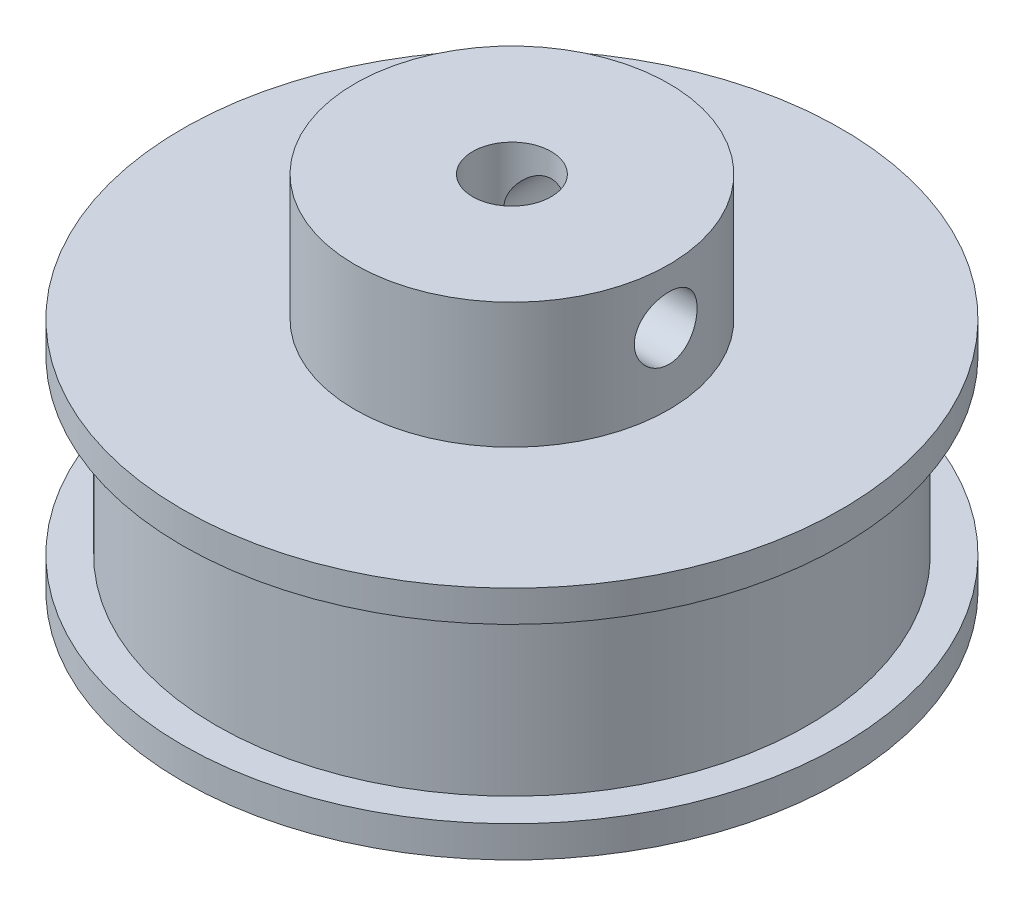
ISO-10303-21;
HEADER;
FILE_DESCRIPTION(('STEP AP214'),'2;1');
FILE_NAME('part.step','',(''),(''),'','','');
FILE_SCHEMA(('AUTOMOTIVE_DESIGN { 1 0 10303 214 1 1 1 1 }'));
ENDSEC;
DATA;
#1=APPLICATION_CONTEXT('core data for automotive mechanical design processes');
#2=APPLICATION_PROTOCOL_DEFINITION('international standard','automotive_design',2000,#1);
#3=PRODUCT_CONTEXT('',#1,'mechanical');
#4=PRODUCT('Part','Part','',(#3));
#5=PRODUCT_RELATED_PRODUCT_CATEGORY('part','',(#4));
#6=PRODUCT_DEFINITION_FORMATION('','',#4);
#7=PRODUCT_DEFINITION_CONTEXT('part definition',#1,'design');
#8=PRODUCT_DEFINITION('design','',#6,#7);
#9=PRODUCT_DEFINITION_SHAPE('','',#8);
#10=(LENGTH_UNIT() NAMED_UNIT(*) SI_UNIT(.MILLI.,.METRE.));
#11=(NAMED_UNIT(*) PLANE_ANGLE_UNIT() SI_UNIT($,.RADIAN.));
#12=(NAMED_UNIT(*) SI_UNIT($,.STERADIAN.) SOLID_ANGLE_UNIT());
#13=UNCERTAINTY_MEASURE_WITH_UNIT(LENGTH_MEASURE(1.E-05),#10,'distance_accuracy_value','');
#14=(GEOMETRIC_REPRESENTATION_CONTEXT(3) GLOBAL_UNCERTAINTY_ASSIGNED_CONTEXT((#13)) GLOBAL_UNIT_ASSIGNED_CONTEXT((#10,
#11,#12)) REPRESENTATION_CONTEXT('',''));
#15=CARTESIAN_POINT('',(0.,0.,0.));
#16=DIRECTION('',(0.,0.,1.));
#17=DIRECTION('',(1.,0.,0.));
#18=AXIS2_PLACEMENT_3D('',#15,#16,#17);
#19=CARTESIAN_POINT('',(0.,2.,0.));
#20=DIRECTION('',(0.,-1.,0.));
#21=DIRECTION('',(0.,0.,-1.));
#22=AXIS2_PLACEMENT_3D('',#19,#20,#21);
#23=CYLINDRICAL_SURFACE('',#22,21.);
#24=CARTESIAN_POINT('',(0.,2.,0.));
#25=DIRECTION('',(0.,1.,0.));
#26=DIRECTION('',(0.,0.,1.));
#27=AXIS2_PLACEMENT_3D('',#24,#25,#26);
#28=CIRCLE('',#27,21.);
#29=CARTESIAN_POINT('',(0.,2.,21.));
#30=VERTEX_POINT('',#29);
#31=EDGE_CURVE('E135',#30,#30,#28,.T.);
#32=ORIENTED_EDGE('',*,*,#31,.F.);
#33=EDGE_LOOP('',(#32));
#34=FACE_BOUND('',#33,.T.);
#35=CARTESIAN_POINT('',(0.,0.,0.));
#36=DIRECTION('',(0.,1.,0.));
#37=DIRECTION('',(0.,0.,1.));
#38=AXIS2_PLACEMENT_3D('',#35,#36,#37);
#39=CIRCLE('',#38,21.);
#40=CARTESIAN_POINT('',(0.,0.,21.));
#41=VERTEX_POINT('',#40);
#42=EDGE_CURVE('E76',#41,#41,#39,.T.);
#43=ORIENTED_EDGE('',*,*,#42,.T.);
#44=EDGE_LOOP('',(#43));
#45=FACE_BOUND('',#44,.T.);
#46=ADVANCED_FACE('F37',(#34,#45),#23,.T.);
#47=CARTESIAN_POINT('',(0.,2.,0.));
#48=DIRECTION('',(0.,1.,0.));
#49=DIRECTION('',(0.,0.,1.));
#50=AXIS2_PLACEMENT_3D('',#47,#48,#49);
#51=PLANE('',#50);
#52=CARTESIAN_POINT('',(0.,2.,0.));
#53=DIRECTION('',(0.,1.,0.));
#54=DIRECTION('',(0.,0.,1.));
#55=AXIS2_PLACEMENT_3D('',#52,#53,#54);
#56=CIRCLE('',#55,18.85);
#57=CARTESIAN_POINT('',(0.,2.,18.85));
#58=VERTEX_POINT('',#57);
#59=EDGE_CURVE('E139',#58,#58,#56,.T.);
#60=ORIENTED_EDGE('',*,*,#59,.F.);
#61=EDGE_LOOP('',(#60));
#62=FACE_BOUND('',#61,.T.);
#63=ORIENTED_EDGE('',*,*,#31,.T.);
#64=EDGE_LOOP('',(#63));
#65=FACE_BOUND('',#64,.T.);
#66=ADVANCED_FACE('F119',(#62,#65),#51,.T.);
#67=CARTESIAN_POINT('',(0.,0.,0.));
#68=DIRECTION('',(0.,1.,0.));
#69=DIRECTION('',(0.,0.,1.));
#70=AXIS2_PLACEMENT_3D('',#67,#68,#69);
#71=PLANE('',#70);
#72=CARTESIAN_POINT('',(0.,0.,0.));
#73=DIRECTION('',(0.,1.,0.));
#74=DIRECTION('',(0.,0.,1.));
#75=AXIS2_PLACEMENT_3D('',#72,#73,#74);
#76=CIRCLE('',#75,2.5);
#77=CARTESIAN_POINT('',(0.,0.,2.5));
#78=VERTEX_POINT('',#77);
#79=EDGE_CURVE('E93',#78,#78,#76,.T.);
#80=ORIENTED_EDGE('',*,*,#79,.T.);
#81=EDGE_LOOP('',(#80));
#82=FACE_BOUND('',#81,.T.);
#83=ORIENTED_EDGE('',*,*,#42,.F.);
#84=EDGE_LOOP('',(#83));
#85=FACE_BOUND('',#84,.T.);
#86=ADVANCED_FACE('F117',(#82,#85),#71,.F.);
#87=CARTESIAN_POINT('',(0.,13.,0.));
#88=DIRECTION('',(0.,-1.,0.));
#89=DIRECTION('',(0.,0.,-1.));
#90=AXIS2_PLACEMENT_3D('',#87,#88,#89);
#91=CYLINDRICAL_SURFACE('',#90,18.85);
#92=CARTESIAN_POINT('',(0.,13.,0.));
#93=DIRECTION('',(0.,1.,0.));
#94=DIRECTION('',(0.,0.,1.));
#95=AXIS2_PLACEMENT_3D('',#92,#93,#94);
#96=CIRCLE('',#95,18.85);
#97=CARTESIAN_POINT('',(0.,13.,18.85));
#98=VERTEX_POINT('',#97);
#99=EDGE_CURVE('E138',#98,#98,#96,.T.);
#100=ORIENTED_EDGE('',*,*,#99,.F.);
#101=EDGE_LOOP('',(#100));
#102=FACE_BOUND('',#101,.T.);
#103=ORIENTED_EDGE('',*,*,#59,.T.);
#104=EDGE_LOOP('',(#103));
#105=FACE_BOUND('',#104,.T.);
#106=ADVANCED_FACE('F113',(#102,#105),#91,.T.);
#107=CARTESIAN_POINT('',(0.,15.,0.));
#108=DIRECTION('',(0.,-1.,0.));
#109=DIRECTION('',(0.,0.,-1.));
#110=AXIS2_PLACEMENT_3D('',#107,#108,#109);
#111=CYLINDRICAL_SURFACE('',#110,21.);
#112=CARTESIAN_POINT('',(0.,15.,0.));
#113=DIRECTION('',(0.,1.,0.));
#114=DIRECTION('',(0.,0.,1.));
#115=AXIS2_PLACEMENT_3D('',#112,#113,#114);
#116=CIRCLE('',#115,21.);
#117=CARTESIAN_POINT('',(0.,15.,21.));
#118=VERTEX_POINT('',#117);
#119=EDGE_CURVE('E141',#118,#118,#116,.T.);
#120=ORIENTED_EDGE('',*,*,#119,.F.);
#121=EDGE_LOOP('',(#120));
#122=FACE_BOUND('',#121,.T.);
#123=CARTESIAN_POINT('',(0.,13.,0.));
#124=DIRECTION('',(0.,1.,0.));
#125=DIRECTION('',(0.,0.,1.));
#126=AXIS2_PLACEMENT_3D('',#123,#124,#125);
#127=CIRCLE('',#126,21.);
#128=CARTESIAN_POINT('',(0.,13.,21.));
#129=VERTEX_POINT('',#128);
#130=EDGE_CURVE('E145',#129,#129,#127,.T.);
#131=ORIENTED_EDGE('',*,*,#130,.T.);
#132=EDGE_LOOP('',(#131));
#133=FACE_BOUND('',#132,.T.);
#134=ADVANCED_FACE('F106',(#122,#133),#111,.T.);
#135=CARTESIAN_POINT('',(0.,15.,0.));
#136=DIRECTION('',(0.,1.,0.));
#137=DIRECTION('',(0.,0.,1.));
#138=AXIS2_PLACEMENT_3D('',#135,#136,#137);
#139=PLANE('',#138);
#140=CARTESIAN_POINT('',(0.,15.,0.));
#141=DIRECTION('',(0.,1.,0.));
#142=DIRECTION('',(0.,0.,1.));
#143=AXIS2_PLACEMENT_3D('',#140,#141,#142);
#144=CIRCLE('',#143,10.);
#145=CARTESIAN_POINT('',(0.,15.,10.));
#146=VERTEX_POINT('',#145);
#147=EDGE_CURVE('E44',#146,#146,#144,.T.);
#148=ORIENTED_EDGE('',*,*,#147,.F.);
#149=EDGE_LOOP('',(#148));
#150=FACE_BOUND('',#149,.T.);
#151=ORIENTED_EDGE('',*,*,#119,.T.);
#152=EDGE_LOOP('',(#151));
#153=FACE_BOUND('',#152,.T.);
#154=ADVANCED_FACE('F102',(#150,#153),#139,.T.);
#155=CARTESIAN_POINT('',(0.,13.,0.));
#156=DIRECTION('',(0.,1.,0.));
#157=DIRECTION('',(0.,0.,1.));
#158=AXIS2_PLACEMENT_3D('',#155,#156,#157);
#159=PLANE('',#158);
#160=ORIENTED_EDGE('',*,*,#99,.T.);
#161=EDGE_LOOP('',(#160));
#162=FACE_BOUND('',#161,.T.);
#163=ORIENTED_EDGE('',*,*,#130,.F.);
#164=EDGE_LOOP('',(#163));
#165=FACE_BOUND('',#164,.T.);
#166=ADVANCED_FACE('F100',(#162,#165),#159,.F.);
#167=CARTESIAN_POINT('',(0.,23.,0.));
#168=DIRECTION('',(0.,-1.,0.));
#169=DIRECTION('',(0.,0.,-1.));
#170=AXIS2_PLACEMENT_3D('',#167,#168,#169);
#171=CYLINDRICAL_SURFACE('',#170,10.);
#172=CARTESIAN_POINT('',(9.79795897113271,19.5,2.00000000000003));
#173=CARTESIAN_POINT('',(9.79796118053292,19.6111287509823,1.99999589175058));
#174=CARTESIAN_POINT('',(9.79987016537403,19.7223092466667,1.99070634343632));
#175=CARTESIAN_POINT('',(9.80728862609748,19.9415250102863,1.95382456716572));
#176=CARTESIAN_POINT('',(9.81280098289574,20.049557689272,1.92621769414102));
#177=CARTESIAN_POINT('',(9.82677747443708,20.2592746067084,1.85359156523953));
#178=CARTESIAN_POINT('',(9.8352386724215,20.3609650430652,1.80858962830528));
#179=CARTESIAN_POINT('',(9.85415598961316,20.5553496893939,1.70249821534105));
#180=CARTESIAN_POINT('',(9.86461199746922,20.6480444010758,1.64140963720234));
#181=CARTESIAN_POINT('',(9.88650599388505,20.8231220077077,1.50395815130691));
#182=CARTESIAN_POINT('',(9.89795475674492,20.9053591757679,1.42741131182667));
#183=CARTESIAN_POINT('',(9.92044944605196,21.055915067158,1.26161357804265));
#184=CARTESIAN_POINT('',(9.93149534421663,21.1242328148344,1.172361793956));
#185=CARTESIAN_POINT('',(9.95205592835124,21.2455760352569,0.982722711848546));
#186=CARTESIAN_POINT('',(9.96155642883101,21.2984630276333,0.882245135344454));
#187=CARTESIAN_POINT('',(9.97783473767263,21.3865498740963,0.673608300774577));
#188=CARTESIAN_POINT('',(9.98461280088238,21.421751383802,0.56544976284114));
#189=CARTESIAN_POINT('',(9.99460641376837,21.4730143872393,0.346033546557024));
#190=CARTESIAN_POINT('',(9.99786772576254,21.489321955142,0.234835478429663));
#191=CARTESIAN_POINT('',(10.0006184236721,21.5031019036766,0.0112371368751075));
#192=CARTESIAN_POINT('',(10.0001081730552,21.5005760992916,-0.101163019663651));
#193=CARTESIAN_POINT('',(9.99540869737031,21.4769476395689,-0.322284001487142));
#194=CARTESIAN_POINT('',(9.99127196731677,21.4561100456643,-0.431034428596905));
#195=CARTESIAN_POINT('',(9.97984354318817,21.3968699350822,-0.643463253160568));
#196=CARTESIAN_POINT('',(9.97255172288078,21.3584667156163,-0.747141447494224));
#197=CARTESIAN_POINT('',(9.95554592039917,21.2649399197055,-0.94723892640174));
#198=CARTESIAN_POINT('',(9.94581696350448,21.2097124977902,-1.04360834826776));
#199=CARTESIAN_POINT('',(9.92500938947571,21.0841818455268,-1.22581009171948));
#200=CARTESIAN_POINT('',(9.91393061710445,21.013876880459,-1.31164119904997));
#201=CARTESIAN_POINT('',(9.8914192872892,20.8587327557831,-1.47190286210688));
#202=CARTESIAN_POINT('',(9.87998392915033,20.7736616265408,-1.54610863314723));
#203=CARTESIAN_POINT('',(9.85823143197522,20.5921671150985,-1.67923698635358));
#204=CARTESIAN_POINT('',(9.84791431409097,20.4957435182336,-1.73815927945547));
#205=CARTESIAN_POINT('',(9.82956094945848,20.2939583363564,-1.83912562960373));
#206=CARTESIAN_POINT('',(9.82152963127099,20.1885780647207,-1.88113329555538));
#207=CARTESIAN_POINT('',(9.80872952642546,19.972057352552,-1.94678068325513));
#208=CARTESIAN_POINT('',(9.80396031456856,19.8609176647618,-1.97042279891325));
#209=CARTESIAN_POINT('',(9.79830958535656,19.6380702840019,-1.99833201207207));
#210=CARTESIAN_POINT('',(9.79736294114309,19.5264048513793,-2.00292371779579));
#211=CARTESIAN_POINT('',(9.79928971377708,19.3039035536006,-1.99347525662144));
#212=CARTESIAN_POINT('',(9.80216291400776,19.1930676417623,-1.97943614624485));
#213=CARTESIAN_POINT('',(9.8113446498983,18.9764627194155,-1.93340441614828));
#214=CARTESIAN_POINT('',(9.81761998028994,18.8706553139285,-1.90158524167856));
#215=CARTESIAN_POINT('',(9.8328697870333,18.6658734419425,-1.821082070617));
#216=CARTESIAN_POINT('',(9.8418444857254,18.5668995391286,-1.77239668474632));
#217=CARTESIAN_POINT('',(9.86162811924079,18.3771737800997,-1.65880828443116));
#218=CARTESIAN_POINT('',(9.87245943729807,18.2865459073983,-1.59370215596547));
#219=CARTESIAN_POINT('',(9.89467447653273,18.1173833759982,-1.44939114442539));
#220=CARTESIAN_POINT('',(9.90605825447637,18.0388499635015,-1.37018481028904));
#221=CARTESIAN_POINT('',(9.92830691738432,17.8948748816288,-1.19846454699575));
#222=CARTESIAN_POINT('',(9.93916115417368,17.8296526907,-1.10576499785922));
#223=CARTESIAN_POINT('',(9.9589425525724,17.7157082370008,-0.910535793269477));
#224=CARTESIAN_POINT('',(9.96786979510423,17.6669852813104,-0.808006550866979));
#225=CARTESIAN_POINT('',(9.98274588122133,17.5877422565067,-0.596605361647991));
#226=CARTESIAN_POINT('',(9.98871158285205,17.5571189635475,-0.487773346956122));
#227=CARTESIAN_POINT('',(9.99706471875323,17.5146175046723,-0.266378909359789));
#228=CARTESIAN_POINT('',(9.99945258399698,17.5027370810486,-0.153816937422389));
#229=CARTESIAN_POINT('',(10.0003708090823,17.4981460380742,0.0697457878072766));
#230=CARTESIAN_POINT('',(9.99896757098659,17.5051054390875,0.180739624283022));
#231=CARTESIAN_POINT('',(9.99260087120678,17.5372679010957,0.399942062631334));
#232=CARTESIAN_POINT('',(9.98763745428862,17.5624707326963,0.508150699507479));
#233=CARTESIAN_POINT('',(9.97470996729841,17.6302579841832,0.718505499490164));
#234=CARTESIAN_POINT('',(9.9667527449523,17.672802756262,0.820664886480363));
#235=CARTESIAN_POINT('',(9.9486944424736,17.7740244826622,1.01644244037217));
#236=CARTESIAN_POINT('',(9.93859319293975,17.832702711809,1.11005993153573));
#237=CARTESIAN_POINT('',(9.9171519831348,17.9656387741226,1.28772778021187));
#238=CARTESIAN_POINT('',(9.90579466835801,18.0401326727676,1.37159943222972));
#239=CARTESIAN_POINT('',(9.8832244581573,18.2021004801975,1.52576523551705));
#240=CARTESIAN_POINT('',(9.87201159757437,18.2895774589598,1.59605616641786));
#241=CARTESIAN_POINT('',(9.85086685467862,18.4761586333809,1.7217844389));
#242=CARTESIAN_POINT('',(9.84095007142451,18.5753779222425,1.77705362923621));
#243=CARTESIAN_POINT('',(9.82370474252825,18.7818655465202,1.87004809853249));
#244=CARTESIAN_POINT('',(9.81637385049967,18.8891264773744,1.90778929194836));
#245=CARTESIAN_POINT('',(9.80659362275689,19.0805249108857,1.95733827971535));
#246=CARTESIAN_POINT('',(9.80337569829211,19.1635708390279,1.9733077970474));
#247=CARTESIAN_POINT('',(9.79905756918168,19.3310679091023,1.99464003591946));
#248=CARTESIAN_POINT('',(9.79795729152835,19.4155190024889,2.00000312312532));
#249=CARTESIAN_POINT('',(9.79795897113271,19.5,2.00000000000003));
#250=B_SPLINE_CURVE_WITH_KNOTS('',3,(#172,#173,#174,#175,#176,#177,#178,#179,#180,#181,#182,
#183,#184,#185,#186,#187,#188,#189,#190,#191,#192,#193,#194,#195,#196,#197,#198,#199,#200,#201,
#202,#203,#204,#205,#206,#207,#208,#209,#210,#211,#212,#213,#214,#215,#216,#217,#218,#219,#220,
#221,#222,#223,#224,#225,#226,#227,#228,#229,#230,#231,#232,#233,#234,#235,#236,#237,#238,#239,
#240,#241,#242,#243,#244,#245,#246,#247,#248,#249),.UNSPECIFIED.,.T.,.F.,(4,2,2,2,2,2,2,2,2,2,2,
2,2,2,2,2,2,2,2,2,2,2,2,2,2,2,2,2,2,2,2,2,2,2,2,2,2,2,4),(0.,0.333076927738854,
0.666420478568594,0.999432995881169,1.33242692971973,1.66964505096874,2.00688680070844,
2.34706800874901,2.6872173649312,3.02288497766161,3.35852024232497,3.68937579267075,
4.020244581475,4.35319848444607,4.68619071540132,5.02498693524967,5.36378956245441,
5.70331726345553,6.04280070032049,6.37647515609187,6.71013069056843,7.04058683566638,
7.37107020708797,7.70586119549042,8.04068665740418,8.38065203466902,8.7206031326021,
9.05859627157301,9.39654869383256,9.72862034829372,10.0606878273351,10.392000341509,
10.7233390426937,11.0600230405119,11.3967867777956,11.7371779715921,12.077259501804,
12.3304760727632,12.5836839137096),.UNSPECIFIED.);
#251=CARTESIAN_POINT('',(9.79795897113271,19.5,2.00000000000003));
#252=VERTEX_POINT('',#251);
#253=EDGE_CURVE('E60',#252,#252,#250,.T.);
#254=ORIENTED_EDGE('',*,*,#253,.T.);
#255=EDGE_LOOP('',(#254));
#256=FACE_BOUND('',#255,.T.);
#257=CARTESIAN_POINT('',(0.,21.5,-10.));
#258=CARTESIAN_POINT('',(-0.111153813585266,21.4999959110033,-9.99999795161742));
#259=CARTESIAN_POINT('',(-0.222359320403045,21.4907023140647,-9.99812770356462));
#260=CARTESIAN_POINT('',(-0.441627015378039,21.4538029997695,-9.99084731246463));
#261=CARTESIAN_POINT('',(-0.549686635082712,21.426182734397,-9.98543435720372));
#262=CARTESIAN_POINT('',(-0.759460610526626,21.3535174527584,-9.97167298556573));
#263=CARTESIAN_POINT('',(-0.861180935866268,21.3084891263106,-9.96332738153436));
#264=CARTESIAN_POINT('',(-1.05561597772845,21.2023355049774,-9.94460796070629));
#265=CARTESIAN_POINT('',(-1.14833123015162,21.1412111687856,-9.93423426471414));
#266=CARTESIAN_POINT('',(-1.32338695462973,21.0037230114171,-9.9124433065994));
#267=CARTESIAN_POINT('',(-1.40558790231705,20.9271832892176,-9.90101491008695));
#268=CARTESIAN_POINT('',(-1.55607351321606,20.7614151672166,-9.87848360905177));
#269=CARTESIAN_POINT('',(-1.62435708954085,20.6721857773298,-9.86738073000848));
#270=CARTESIAN_POINT('',(-1.74566350669524,20.4825676139762,-9.8466488362523));
#271=CARTESIAN_POINT('',(-1.79854187773173,20.3820847124073,-9.83703414729892));
#272=CARTESIAN_POINT('',(-1.88661133316062,20.1734363619918,-9.82052536116836));
#273=CARTESIAN_POINT('',(-1.92180416487448,20.0652716733073,-9.81363099523923));
#274=CARTESIAN_POINT('',(-1.97305059976966,19.8458312721842,-9.80345610504409));
#275=CARTESIAN_POINT('',(-1.98934899591756,19.7346149117155,-9.80012940214375));
#276=CARTESIAN_POINT('',(-2.00310425545224,19.5109803572713,-9.79732750121254));
#277=CARTESIAN_POINT('',(-2.000563045427,19.3985622873597,-9.79785190935681));
#278=CARTESIAN_POINT('',(-1.97690914620364,19.177506423958,-9.80265102296369));
#279=CARTESIAN_POINT('',(-1.95607708048781,19.0688371887454,-9.80686905717527));
#280=CARTESIAN_POINT('',(-1.8968757692461,18.856567846674,-9.81849092320002));
#281=CARTESIAN_POINT('',(-1.85850568620136,18.752967982162,-9.82589490715558));
#282=CARTESIAN_POINT('',(-1.76504956734944,18.5529694765928,-9.84311237000816));
#283=CARTESIAN_POINT('',(-1.70985230246423,18.4566242408617,-9.85294179627409));
#284=CARTESIAN_POINT('',(-1.58438714914536,18.2744583000544,-9.87389237546124));
#285=CARTESIAN_POINT('',(-1.51411752871366,18.1886388062977,-9.88501367676732));
#286=CARTESIAN_POINT('',(-1.35899986912117,18.0283411950861,-9.90754042482924));
#287=CARTESIAN_POINT('',(-1.27391232242489,17.9540948642817,-9.9189473842181));
#288=CARTESIAN_POINT('',(-1.09237004812402,17.8208923073975,-9.94057697428817));
#289=CARTESIAN_POINT('',(-0.995915174758778,17.7619362774128,-9.95079958977947));
#290=CARTESIAN_POINT('',(-0.794118773757842,17.6609449815481,-9.96893380321774));
#291=CARTESIAN_POINT('',(-0.688763639170601,17.6189362127109,-9.97684177696544));
#292=CARTESIAN_POINT('',(-0.47229795289733,17.5532790519229,-9.98942817975717));
#293=CARTESIAN_POINT('',(-0.3611881001449,17.5296284358527,-9.99410700001063));
#294=CARTESIAN_POINT('',(-0.138358811254301,17.5016870924114,-9.99965343733735));
#295=CARTESIAN_POINT('',(-0.0266806566511525,17.4970791609195,-10.0005834930494));
#296=CARTESIAN_POINT('',(0.195849868385428,17.5064997178844,-9.99870103860205));
#297=CARTESIAN_POINT('',(0.306702284887587,17.5205271587052,-9.99588873882892));
#298=CARTESIAN_POINT('',(0.523411319893083,17.5665567470879,-9.98687664016035));
#299=CARTESIAN_POINT('',(0.629303896679808,17.5983961369958,-9.98070752808413));
#300=CARTESIAN_POINT('',(0.834247254999335,17.6789679653116,-9.96567104122065));
#301=CARTESIAN_POINT('',(0.93329752327508,17.7277016693537,-9.95680346428453));
#302=CARTESIAN_POINT('',(1.12308234737243,17.8413649813026,-9.93719823066589));
#303=CARTESIAN_POINT('',(1.21370025350438,17.9064855620779,-9.92643900874103));
#304=CARTESIAN_POINT('',(1.38283603823841,18.0508183824146,-9.90429469659765));
#305=CARTESIAN_POINT('',(1.46135261786153,18.1300321327997,-9.89290953936776));
#306=CARTESIAN_POINT('',(1.60528118154835,18.3017467037822,-9.8705860711393));
#307=CARTESIAN_POINT('',(1.67047540489731,18.3944314884427,-9.85965720466608));
#308=CARTESIAN_POINT('',(1.78437084010241,18.5896227227134,-9.83968383592388));
#309=CARTESIAN_POINT('',(1.83307271184581,18.6921287791471,-9.83063925826685));
#310=CARTESIAN_POINT('',(1.91230368316392,18.9035364922991,-9.81553481168766));
#311=CARTESIAN_POINT('',(1.9429269995821,19.0124016824206,-9.80945949744373));
#312=CARTESIAN_POINT('',(1.98541730325439,19.2338669069818,-9.8009487358405));
#313=CARTESIAN_POINT('',(1.99728673645023,19.3464664524187,-9.79851281382223));
#314=CARTESIAN_POINT('',(2.00184182173494,19.5700177290886,-9.79758299262758));
#315=CARTESIAN_POINT('',(1.99487157614179,19.680962297854,-9.79901838378602));
#316=CARTESIAN_POINT('',(1.96270460820012,19.9000632998101,-9.80551146969228));
#317=CARTESIAN_POINT('',(1.9375080322586,20.0082197553896,-9.81056913534338));
#318=CARTESIAN_POINT('',(1.86975713699791,20.2184554224811,-9.82370528438317));
#319=CARTESIAN_POINT('',(1.82724501343469,20.3205487210048,-9.83177642037661));
#320=CARTESIAN_POINT('',(1.72610928920321,20.5162074414689,-9.85003429948341));
#321=CARTESIAN_POINT('',(1.66748433754976,20.6097721474503,-9.86022121997788));
#322=CARTESIAN_POINT('',(1.53461182957283,20.7874311443006,-9.88177921046451));
#323=CARTESIAN_POINT('',(1.46011577447036,20.8713375305352,-9.89316745819399));
#324=CARTESIAN_POINT('',(1.29812873802628,21.0255724110583,-9.91572163743909));
#325=CARTESIAN_POINT('',(1.21063477430667,21.0958977806345,-9.92688751726369));
#326=CARTESIAN_POINT('',(1.02403525817649,21.2216692878929,-9.94787664775943));
#327=CARTESIAN_POINT('',(0.924817768859668,21.2769520065601,-9.95768462438492));
#328=CARTESIAN_POINT('',(0.718332721881463,21.3699722451932,-9.9747025017));
#329=CARTESIAN_POINT('',(0.61107252172625,21.407725579065,-9.98191474277232));
#330=CARTESIAN_POINT('',(0.419642977847557,21.4573038960894,-9.99152745190741));
#331=CARTESIAN_POINT('',(0.336563328027567,21.4732863874155,-9.99468606316904));
#332=CARTESIAN_POINT('',(0.168999050420133,21.4946358247167,-9.99892308279786));
#333=CARTESIAN_POINT('',(0.0845144674972376,21.5000031090195,-10.0000015574631));
#334=CARTESIAN_POINT('',(0.,21.5,-10.));
#335=B_SPLINE_CURVE_WITH_KNOTS('',3,(#257,#258,#259,#260,#261,#262,#263,#264,#265,#266,#267,
#268,#269,#270,#271,#272,#273,#274,#275,#276,#277,#278,#279,#280,#281,#282,#283,#284,#285,#286,
#287,#288,#289,#290,#291,#292,#293,#294,#295,#296,#297,#298,#299,#300,#301,#302,#303,#304,#305,
#306,#307,#308,#309,#310,#311,#312,#313,#314,#315,#316,#317,#318,#319,#320,#321,#322,#323,#324,
#325,#326,#327,#328,#329,#330,#331,#332,#333,#334),.UNSPECIFIED.,.T.,.F.,(4,2,2,2,2,2,2,2,2,2,2,
2,2,2,2,2,2,2,2,2,2,2,2,2,2,2,2,2,2,2,2,2,2,2,2,2,2,2,4),(0.,0.333152261322517,
0.666569301382646,0.999667470500683,1.33274580446173,1.66986534022437,2.00701119349473,
2.34722390011846,2.68740298730395,3.02312370207175,3.3588100856245,3.68943454012557,
4.02007478507459,4.35294980407186,4.68586309499341,5.02476504982702,5.3636713507964,
5.70310549708048,6.04249851396072,6.37621471352531,6.70991215315735,7.04060907901447,
7.37133078432045,7.70610132066717,8.0409077669186,8.38081257158452,8.72070377446933,
9.05880762065446,9.39686736660829,9.72879445135403,10.0607188698522,10.3918392250622,
10.7229873516373,11.0597615247829,11.3966130906586,11.7369899335127,12.0770591103504,
12.3303755057979,12.5836838274199),.UNSPECIFIED.);
#336=CARTESIAN_POINT('',(0.,21.5,-10.));
#337=VERTEX_POINT('',#336);
#338=EDGE_CURVE('E64',#337,#337,#335,.T.);
#339=ORIENTED_EDGE('',*,*,#338,.T.);
#340=EDGE_LOOP('',(#339));
#341=FACE_BOUND('',#340,.T.);
#342=CARTESIAN_POINT('',(0.,23.,0.));
#343=DIRECTION('',(0.,1.,0.));
#344=DIRECTION('',(0.,0.,1.));
#345=AXIS2_PLACEMENT_3D('',#342,#343,#344);
#346=CIRCLE('',#345,10.);
#347=CARTESIAN_POINT('',(0.,23.,10.));
#348=VERTEX_POINT('',#347);
#349=EDGE_CURVE('E157',#348,#348,#346,.T.);
#350=ORIENTED_EDGE('',*,*,#349,.F.);
#351=EDGE_LOOP('',(#350));
#352=FACE_BOUND('',#351,.T.);
#353=ORIENTED_EDGE('',*,*,#147,.T.);
#354=EDGE_LOOP('',(#353));
#355=FACE_BOUND('',#354,.T.);
#356=ADVANCED_FACE('F95',(#256,#341,#352,#355),#171,.T.);
#357=CARTESIAN_POINT('',(0.,23.,0.));
#358=DIRECTION('',(0.,1.,0.));
#359=DIRECTION('',(0.,0.,1.));
#360=AXIS2_PLACEMENT_3D('',#357,#358,#359);
#361=PLANE('',#360);
#362=CARTESIAN_POINT('',(0.,23.,0.));
#363=DIRECTION('',(0.,1.,0.));
#364=DIRECTION('',(0.,0.,1.));
#365=AXIS2_PLACEMENT_3D('',#362,#363,#364);
#366=CIRCLE('',#365,2.5);
#367=CARTESIAN_POINT('',(0.,23.,2.5));
#368=VERTEX_POINT('',#367);
#369=EDGE_CURVE('E66',#368,#368,#366,.T.);
#370=ORIENTED_EDGE('',*,*,#369,.F.);
#371=EDGE_LOOP('',(#370));
#372=FACE_BOUND('',#371,.T.);
#373=ORIENTED_EDGE('',*,*,#349,.T.);
#374=EDGE_LOOP('',(#373));
#375=FACE_BOUND('',#374,.T.);
#376=ADVANCED_FACE('F99',(#372,#375),#361,.T.);
#377=CARTESIAN_POINT('',(0.,0.,0.));
#378=DIRECTION('',(0.,1.,0.));
#379=DIRECTION('',(0.,0.,1.));
#380=AXIS2_PLACEMENT_3D('',#377,#378,#379);
#381=CYLINDRICAL_SURFACE('',#380,2.5);
#382=CARTESIAN_POINT('',(2.,19.5,-1.5));
#383=CARTESIAN_POINT('',(1.9999899563842,19.4249189826114,-1.50002275759911));
#384=CARTESIAN_POINT('',(1.99572243014959,19.3497210739064,-1.50575588676017));
#385=CARTESIAN_POINT('',(1.97904350434638,19.2016854705704,-1.52759797098302));
#386=CARTESIAN_POINT('',(1.96660415938922,19.1288567781879,-1.54374252679463));
#387=CARTESIAN_POINT('',(1.9288828901246,18.9623945804914,-1.59078313764401));
#388=CARTESIAN_POINT('',(1.90063587852784,18.8703574929004,-1.62485949442395));
#389=CARTESIAN_POINT('',(1.83286412912234,18.6940318598387,-1.70094533012843));
#390=CARTESIAN_POINT('',(1.79330760683741,18.6097660503329,-1.74297705283046));
#391=CARTESIAN_POINT('',(1.68777756612173,18.4196603432195,-1.84624966659378));
#392=CARTESIAN_POINT('',(1.6174236371176,18.3170334258727,-1.90894188114929));
#393=CARTESIAN_POINT('',(1.45861935064739,18.1260231647878,-2.03287996747903));
#394=CARTESIAN_POINT('',(1.370184076822,18.0376280578861,-2.0941269976447));
#395=CARTESIAN_POINT('',(1.19476026278806,17.8928950804225,-2.19790674394511));
#396=CARTESIAN_POINT('',(1.11093376146689,17.8336737173159,-2.24174680788007));
#397=CARTESIAN_POINT('',(0.932444755507563,17.7276340400337,-2.32165152523267));
#398=CARTESIAN_POINT('',(0.837799422094951,17.6807964517991,-2.35772824500368));
#399=CARTESIAN_POINT('',(0.65531708222255,17.6082870394193,-2.41415644696378));
#400=CARTESIAN_POINT('',(0.568853585755696,17.5804174354239,-2.43610736091393));
#401=CARTESIAN_POINT('',(0.391188052921993,17.536501304746,-2.47085912284979));
#402=CARTESIAN_POINT('',(0.299988637312624,17.52044831209,-2.48366497483986));
#403=CARTESIAN_POINT('',(0.115048335136529,17.5011419067099,-2.49907968883617));
#404=CARTESIAN_POINT('',(0.0212997713727031,17.4979328073114,-2.50165324772141));
#405=CARTESIAN_POINT('',(-0.165416366428139,17.5046642348722,-2.49626936144757));
#406=CARTESIAN_POINT('',(-0.25838390412223,17.5146053703685,-2.48831142893578));
#407=CARTESIAN_POINT('',(-0.435683568436096,17.546067986313,-2.4632836571348));
#408=CARTESIAN_POINT('',(-0.520210188917496,17.5669288169561,-2.44673404857181));
#409=CARTESIAN_POINT('',(-0.684171862172424,17.6186952342522,-2.40604493660584));
#410=CARTESIAN_POINT('',(-0.763605624129767,17.6496033554976,-2.38190351809567));
#411=CARTESIAN_POINT('',(-0.92352731823443,17.7236006985885,-2.32486221996811));
#412=CARTESIAN_POINT('',(-1.00337969293305,17.7675765160147,-2.29134265660255));
#413=CARTESIAN_POINT('',(-1.15470891362336,17.8645378595917,-2.21894043646479));
#414=CARTESIAN_POINT('',(-1.22618103296472,17.9175284293631,-2.18005477975512));
#415=CARTESIAN_POINT('',(-1.37426521356106,18.0430618687988,-2.09053510980241));
#416=CARTESIAN_POINT('',(-1.44890108738507,18.1173836142049,-2.03913144290366));
#417=CARTESIAN_POINT('',(-1.58538384993671,18.2762559036507,-1.9349237792571));
#418=CARTESIAN_POINT('',(-1.6472149443604,18.3608188786743,-1.88211814269102));
#419=CARTESIAN_POINT('',(-1.75228528490804,18.5312201958179,-1.78441317626437));
#420=CARTESIAN_POINT('',(-1.79674173995945,18.6161509405137,-1.73924224553799));
#421=CARTESIAN_POINT('',(-1.87389106987978,18.7943664663345,-1.65582105773209));
#422=CARTESIAN_POINT('',(-1.90660965872837,18.8876324203376,-1.61755576516689));
#423=CARTESIAN_POINT('',(-1.95062199735974,19.0527916040277,-1.56393805143324));
#424=CARTESIAN_POINT('',(-1.96540293714784,19.1226128308979,-1.54515601955456));
#425=CARTESIAN_POINT('',(-1.98746978122375,19.2651802059541,-1.51667304681101));
#426=CARTESIAN_POINT('',(-1.99477239579985,19.3379194539107,-1.50695186390373));
#427=CARTESIAN_POINT('',(-2.0012999442642,19.4848633779274,-1.49827790293909));
#428=CARTESIAN_POINT('',(-2.00047806264257,19.5590740850574,-1.49938753445573));
#429=CARTESIAN_POINT('',(-1.99072610261057,19.7060473250374,-1.51230456185752));
#430=CARTESIAN_POINT('',(-1.98178458332099,19.7788076663875,-1.52412705251965));
#431=CARTESIAN_POINT('',(-1.95331430449204,19.9390632026618,-1.56051508430773));
#432=CARTESIAN_POINT('',(-1.9316709289088,20.0255982681308,-1.58755721486228));
#433=CARTESIAN_POINT('',(-1.87841388450525,20.1922908660855,-1.65022809339808));
#434=CARTESIAN_POINT('',(-1.84677049067316,20.2724284809031,-1.6858823654909));
#435=CARTESIAN_POINT('',(-1.75807608919816,20.4615289293493,-1.77903249993889));
#436=CARTESIAN_POINT('',(-1.69602510944931,20.5668953343252,-1.83905564347523));
#437=CARTESIAN_POINT('',(-1.55438039564658,20.764384149242,-1.96026853157683));
#438=CARTESIAN_POINT('',(-1.47476601547362,20.8564907596835,-2.02145957104429));
#439=CARTESIAN_POINT('',(-1.29702304107541,21.027462807345,-2.13993299259158));
#440=CARTESIAN_POINT('',(-1.19864860522964,21.1061226291131,-2.1971478825966));
#441=CARTESIAN_POINT('',(-0.984970277741326,21.2452665274442,-2.30083046289374));
#442=CARTESIAN_POINT('',(-0.869723203455198,21.3058096056706,-2.3473329244064));
#443=CARTESIAN_POINT('',(-0.664531994140981,21.3884905874669,-2.41163161860482));
#444=CARTESIAN_POINT('',(-0.578408265123344,21.4167173769741,-2.43384921549885));
#445=CARTESIAN_POINT('',(-0.401365381235641,21.461432134964,-2.46921550391513));
#446=CARTESIAN_POINT('',(-0.310449944179068,21.4779290645406,-2.48237111815072));
#447=CARTESIAN_POINT('',(-0.125961358052312,21.4981928241047,-2.49854699723994));
#448=CARTESIAN_POINT('',(-0.0323797561454574,21.5019132050583,-2.50153028039159));
#449=CARTESIAN_POINT('',(0.154129494971546,21.4962334907348,-2.49698719993361));
#450=CARTESIAN_POINT('',(0.247057097671181,21.4868324715917,-2.48946009629711));
#451=CARTESIAN_POINT('',(0.424484983307838,21.4563964529088,-2.46524008405095));
#452=CARTESIAN_POINT('',(0.509170159101609,21.4360106685972,-2.44905900306101));
#453=CARTESIAN_POINT('',(0.673520542356739,21.3851465786865,-2.40905201963011));
#454=CARTESIAN_POINT('',(0.753184443303521,21.354665659174,-2.3852241372675));
#455=CARTESIAN_POINT('',(0.913383591851864,21.2816254556074,-2.32886203207214));
#456=CARTESIAN_POINT('',(0.993310088153967,21.238206157889,-2.29572397002092));
#457=CARTESIAN_POINT('',(1.14486396126305,21.1423576629054,-2.22403396009593));
#458=CARTESIAN_POINT('',(1.21648689776308,21.0899236819315,-2.18547913977516));
#459=CARTESIAN_POINT('',(1.36488223995397,20.9657037869963,-2.0966685242987));
#460=CARTESIAN_POINT('',(1.4397080379364,20.8921535866846,-2.04563299169993));
#461=CARTESIAN_POINT('',(1.5766935307999,20.7348830744766,-1.9420131292006));
#462=CARTESIAN_POINT('',(1.63883728583053,20.6511501723947,-1.88942694411834));
#463=CARTESIAN_POINT('',(1.7455126136634,20.4810424554704,-1.79109125321811));
#464=CARTESIAN_POINT('',(1.79106140064658,20.3954274787839,-1.74513263017548));
#465=CARTESIAN_POINT('',(1.87016304685231,20.2156081117486,-1.66007449903139));
#466=CARTESIAN_POINT('',(1.90373836359645,20.1214202219623,-1.62096222081731));
#467=CARTESIAN_POINT('',(1.94914139922438,19.9538606732473,-1.56580101941138));
#468=CARTESIAN_POINT('',(1.96446470848963,19.8825804555928,-1.54635220628734));
#469=CARTESIAN_POINT('',(1.98726282623961,19.7369757290291,-1.51695472225641));
#470=CARTESIAN_POINT('',(1.99476751139893,19.6626639447221,-1.50696990066825));
#471=CARTESIAN_POINT('',(1.99935742227831,19.5586747856577,-1.50085460132402));
#472=CARTESIAN_POINT('',(2.00000392566845,19.5293463217565,-1.49999110491775));
#473=CARTESIAN_POINT('',(2.,19.5,-1.5));
#474=B_SPLINE_CURVE_WITH_KNOTS('',3,(#382,#383,#384,#385,#386,#387,#388,#389,#390,#391,#392,
#393,#394,#395,#396,#397,#398,#399,#400,#401,#402,#403,#404,#405,#406,#407,#408,#409,#410,#411,
#412,#413,#414,#415,#416,#417,#418,#419,#420,#421,#422,#423,#424,#425,#426,#427,#428,#429,#430,
#431,#432,#433,#434,#435,#436,#437,#438,#439,#440,#441,#442,#443,#444,#445,#446,#447,#448,#449,
#450,#451,#452,#453,#454,#455,#456,#457,#458,#459,#460,#461,#462,#463,#464,#465,#466,#467,#468,
#469,#470,#471,#472,#473),.UNSPECIFIED.,.T.,.F.,(4,2,2,2,2,2,2,2,2,2,2,2,2,2,2,2,2,2,2,2,2,2,2,
2,2,2,2,2,2,2,2,2,2,2,2,2,2,2,2,2,2,2,2,2,2,4),(0.,0.225140818813296,0.45105559389502,
0.755714384660879,1.06123795594964,1.47720804611674,1.8928325353688,2.22639303179097,
2.55943127851024,2.83862094435178,3.11765772560939,3.39765639927928,3.67766803055209,
3.94241917501297,4.20723715914625,4.49756510688427,4.78805602626152,5.13841226546404,
5.48919811771067,5.80619193384967,6.12248701337036,6.34307726284837,6.56317352160417,
6.78453876949455,7.00621641426759,7.28428560377194,7.56318925297414,7.96975811975667,
8.37680748728571,8.78961174948153,9.20105660259844,9.47985927613151,9.75844872724252,
10.0380499218877,10.3176708039936,10.5823344198312,10.8470666181456,11.1364335884202,
11.4259545900794,11.7747351905783,12.1239515037794,12.4449574092071,12.7653580273015,
12.9909138326702,13.2156045429056,13.3036035490356),.UNSPECIFIED.);
#475=CARTESIAN_POINT('',(1.76776695296637,18.5645856533065,-1.76776695296637));
#476=VERTEX_POINT('',#475);
#477=CARTESIAN_POINT('',(1.76776695296637,20.4354143466935,-1.76776695296637));
#478=VERTEX_POINT('',#477);
#479=EDGE_CURVE('E59',#476,#478,#474,.T.);
#480=ORIENTED_EDGE('',*,*,#479,.T.);
#481=CARTESIAN_POINT('',(1.49999999999999,19.5,2.00000000000001));
#482=CARTESIAN_POINT('',(1.5000227575991,19.4249189826114,1.9999899563842));
#483=CARTESIAN_POINT('',(1.50575588676016,19.3497210739064,1.99572243014959));
#484=CARTESIAN_POINT('',(1.52759797098301,19.2016854705704,1.97904350434639));
#485=CARTESIAN_POINT('',(1.54374252679463,19.1288567781879,1.96660415938923));
#486=CARTESIAN_POINT('',(1.590783137644,18.9623945804914,1.9288828901246));
#487=CARTESIAN_POINT('',(1.62485949442394,18.8703574929004,1.90063587852784));
#488=CARTESIAN_POINT('',(1.70094533012842,18.6940318598387,1.83286412912235));
#489=CARTESIAN_POINT('',(1.74297705283045,18.6097660503329,1.79330760683741));
#490=CARTESIAN_POINT('',(1.84624966659377,18.4196603432195,1.68777756612173));
#491=CARTESIAN_POINT('',(1.90894188114929,18.3170334258727,1.61742363711761));
#492=CARTESIAN_POINT('',(2.03287996747902,18.1260231647878,1.4586193506474));
#493=CARTESIAN_POINT('',(2.0941269976447,18.0376280578861,1.37018407682201));
#494=CARTESIAN_POINT('',(2.1979067439451,17.8928950804225,1.19476026278807));
#495=CARTESIAN_POINT('',(2.24174680788007,17.8336737173159,1.1109337614669));
#496=CARTESIAN_POINT('',(2.32165152523267,17.7276340400337,0.932444755507568));
#497=CARTESIAN_POINT('',(2.35772824500367,17.6807964517991,0.837799422094955));
#498=CARTESIAN_POINT('',(2.41415644696378,17.6082870394193,0.655317082222553));
#499=CARTESIAN_POINT('',(2.43610736091392,17.5804174354239,0.568853585755699));
#500=CARTESIAN_POINT('',(2.47085912284979,17.536501304746,0.391188052921996));
#501=CARTESIAN_POINT('',(2.48366497483986,17.52044831209,0.299988637312628));
#502=CARTESIAN_POINT('',(2.49907968883617,17.5011419067099,0.115048335136533));
#503=CARTESIAN_POINT('',(2.50165324772141,17.4979328073114,0.0212997713727065));
#504=CARTESIAN_POINT('',(2.49626936144757,17.5046642348722,-0.165416366428135));
#505=CARTESIAN_POINT('',(2.48831142893578,17.5146053703685,-0.258383904122227));
#506=CARTESIAN_POINT('',(2.4632836571348,17.546067986313,-0.435683568436092));
#507=CARTESIAN_POINT('',(2.44673404857181,17.5669288169561,-0.520210188917493));
#508=CARTESIAN_POINT('',(2.40604493660584,17.6186952342522,-0.68417186217242));
#509=CARTESIAN_POINT('',(2.38190351809567,17.6496033554976,-0.763605624129764));
#510=CARTESIAN_POINT('',(2.32486221996811,17.7236006985885,-0.923527318234427));
#511=CARTESIAN_POINT('',(2.29134265660255,17.7675765160147,-1.00337969293304));
#512=CARTESIAN_POINT('',(2.21894043646479,17.8645378595917,-1.15470891362336));
#513=CARTESIAN_POINT('',(2.18005477975512,17.9175284293631,-1.22618103296472));
#514=CARTESIAN_POINT('',(2.09053510980241,18.0430618687988,-1.37426521356106));
#515=CARTESIAN_POINT('',(2.03913144290367,18.1173836142049,-1.44890108738506));
#516=CARTESIAN_POINT('',(1.93492377925711,18.2762559036507,-1.58538384993671));
#517=CARTESIAN_POINT('',(1.88211814269103,18.3608188786743,-1.6472149443604));
#518=CARTESIAN_POINT('',(1.78441317626437,18.5312201958179,-1.75228528490804));
#519=CARTESIAN_POINT('',(1.739242245538,18.6161509405137,-1.79674173995945));
#520=CARTESIAN_POINT('',(1.65582105773209,18.7943664663345,-1.87389106987978));
#521=CARTESIAN_POINT('',(1.6175557651669,18.8876324203376,-1.90660965872837));
#522=CARTESIAN_POINT('',(1.56393805143324,19.0527916040277,-1.95062199735974));
#523=CARTESIAN_POINT('',(1.54515601955457,19.1226128308979,-1.96540293714783));
#524=CARTESIAN_POINT('',(1.51667304681102,19.2651802059541,-1.98746978122375));
#525=CARTESIAN_POINT('',(1.50695186390374,19.3379194539107,-1.99477239579984));
#526=CARTESIAN_POINT('',(1.4982779029391,19.4848633779274,-2.0012999442642));
#527=CARTESIAN_POINT('',(1.49938753445574,19.5590740850574,-2.00047806264257));
#528=CARTESIAN_POINT('',(1.51230456185753,19.7060473250374,-1.99072610261057));
#529=CARTESIAN_POINT('',(1.52412705251966,19.7788076663875,-1.98178458332098));
#530=CARTESIAN_POINT('',(1.56051508430774,19.9390632026618,-1.95331430449203));
#531=CARTESIAN_POINT('',(1.58755721486229,20.0255982681308,-1.9316709289088));
#532=CARTESIAN_POINT('',(1.65022809339808,20.1922908660855,-1.87841388450525));
#533=CARTESIAN_POINT('',(1.68588236549091,20.2724284809031,-1.84677049067316));
#534=CARTESIAN_POINT('',(1.7790324999389,20.4615289293493,-1.75807608919815));
#535=CARTESIAN_POINT('',(1.83905564347524,20.5668953343252,-1.6960251094493));
#536=CARTESIAN_POINT('',(1.96026853157684,20.764384149242,-1.55438039564657));
#537=CARTESIAN_POINT('',(2.0214595710443,20.8564907596835,-1.47476601547361));
#538=CARTESIAN_POINT('',(2.13993299259158,21.027462807345,-1.29702304107541));
#539=CARTESIAN_POINT('',(2.19714788259661,21.1061226291131,-1.19864860522963));
#540=CARTESIAN_POINT('',(2.30083046289375,21.2452665274442,-0.984970277741317));
#541=CARTESIAN_POINT('',(2.34733292440641,21.3058096056706,-0.869723203455189));
#542=CARTESIAN_POINT('',(2.41163161860483,21.3884905874669,-0.664531994140968));
#543=CARTESIAN_POINT('',(2.43384921549886,21.4167173769741,-0.578408265123329));
#544=CARTESIAN_POINT('',(2.46921550391514,21.461432134964,-0.401365381235625));
#545=CARTESIAN_POINT('',(2.48237111815073,21.4779290645406,-0.310449944179053));
#546=CARTESIAN_POINT('',(2.49854699723995,21.4981928241047,-0.125961358052298));
#547=CARTESIAN_POINT('',(2.50153028039159,21.5019132050583,-0.0323797561454427));
#548=CARTESIAN_POINT('',(2.4969871999336,21.4962334907348,0.154129494971561));
#549=CARTESIAN_POINT('',(2.48946009629711,21.4868324715917,0.247057097671196));
#550=CARTESIAN_POINT('',(2.46524008405095,21.4563964529088,0.424484983307853));
#551=CARTESIAN_POINT('',(2.449059003061,21.4360106685972,0.509170159101624));
#552=CARTESIAN_POINT('',(2.4090520196301,21.3851465786865,0.673520542356754));
#553=CARTESIAN_POINT('',(2.38522413726749,21.354665659174,0.753184443303536));
#554=CARTESIAN_POINT('',(2.32886203207213,21.2816254556074,0.913383591851879));
#555=CARTESIAN_POINT('',(2.29572397002091,21.238206157889,0.993310088153983));
#556=CARTESIAN_POINT('',(2.22403396009592,21.1423576629054,1.14486396126306));
#557=CARTESIAN_POINT('',(2.18547913977515,21.0899236819315,1.21648689776309));
#558=CARTESIAN_POINT('',(2.09666852429869,20.9657037869963,1.36488223995399));
#559=CARTESIAN_POINT('',(2.04563299169991,20.8921535866846,1.43970803793641));
#560=CARTESIAN_POINT('',(1.94201312920059,20.7348830744766,1.57669353079991));
#561=CARTESIAN_POINT('',(1.88942694411832,20.6511501723947,1.63883728583054));
#562=CARTESIAN_POINT('',(1.7910912532181,20.4810424554704,1.74551261366341));
#563=CARTESIAN_POINT('',(1.74513263017547,20.3954274787839,1.7910614006466));
#564=CARTESIAN_POINT('',(1.66007449903138,20.2156081117486,1.87016304685232));
#565=CARTESIAN_POINT('',(1.62096222081729,20.1214202219623,1.90373836359646));
#566=CARTESIAN_POINT('',(1.56580101941137,19.9538606732473,1.94914139922439));
#567=CARTESIAN_POINT('',(1.54635220628733,19.8825804555928,1.96446470848964));
#568=CARTESIAN_POINT('',(1.5169547222564,19.7369757290291,1.98726282623962));
#569=CARTESIAN_POINT('',(1.50696990066825,19.6626639447221,1.99476751139894));
#570=CARTESIAN_POINT('',(1.50085460132401,19.5586747856577,1.99935742227831));
#571=CARTESIAN_POINT('',(1.49999110491774,19.5293463217565,2.00000392566845));
#572=CARTESIAN_POINT('',(1.49999999999999,19.5,2.00000000000001));
#573=B_SPLINE_CURVE_WITH_KNOTS('',3,(#481,#482,#483,#484,#485,#486,#487,#488,#489,#490,#491,
#492,#493,#494,#495,#496,#497,#498,#499,#500,#501,#502,#503,#504,#505,#506,#507,#508,#509,#510,
#511,#512,#513,#514,#515,#516,#517,#518,#519,#520,#521,#522,#523,#524,#525,#526,#527,#528,#529,
#530,#531,#532,#533,#534,#535,#536,#537,#538,#539,#540,#541,#542,#543,#544,#545,#546,#547,#548,
#549,#550,#551,#552,#553,#554,#555,#556,#557,#558,#559,#560,#561,#562,#563,#564,#565,#566,#567,
#568,#569,#570,#571,#572),.UNSPECIFIED.,.T.,.F.,(4,2,2,2,2,2,2,2,2,2,2,2,2,2,2,2,2,2,2,2,2,2,2,
2,2,2,2,2,2,2,2,2,2,2,2,2,2,2,2,2,2,2,2,2,2,4),(0.,0.225140818813289,0.451055593895016,
0.75571438466088,1.06123795594964,1.47720804611674,1.8928325353688,2.22639303179098,
2.55943127851025,2.83862094435178,3.1176577256094,3.39765639927928,3.67766803055209,
3.94241917501297,4.20723715914626,4.49756510688428,4.78805602626153,5.13841226546405,
5.48919811771068,5.80619193384967,6.12248701337037,6.34307726284837,6.56317352160417,
6.78453876949455,7.00621641426759,7.28428560377195,7.56318925297414,7.96975811975667,
8.37680748728571,8.78961174948153,9.20105660259845,9.47985927613152,9.75844872724253,
10.0380499218877,10.3176708039936,10.5823344198312,10.8470666181456,11.1364335884203,
11.4259545900794,11.7747351905783,12.1239515037794,12.4449574092071,12.7653580273016,
12.9909138326702,13.2156045429056,13.3036035490356),.UNSPECIFIED.);
#574=EDGE_CURVE('E50',#478,#476,#573,.T.);
#575=ORIENTED_EDGE('',*,*,#574,.T.);
#576=EDGE_LOOP('',(#480,#575));
#577=FACE_BOUND('',#576,.T.);
#578=ORIENTED_EDGE('',*,*,#79,.F.);
#579=EDGE_LOOP('',(#578));
#580=FACE_BOUND('',#579,.T.);
#581=ORIENTED_EDGE('',*,*,#369,.T.);
#582=EDGE_LOOP('',(#581));
#583=FACE_BOUND('',#582,.T.);
#584=ADVANCED_FACE('F57',(#577,#580,#583),#381,.F.);
#585=CARTESIAN_POINT('',(0.,19.5,-21.));
#586=DIRECTION('',(0.,0.,1.));
#587=DIRECTION('',(1.,0.,0.));
#588=AXIS2_PLACEMENT_3D('',#585,#586,#587);
#589=CYLINDRICAL_SURFACE('',#588,2.);
#590=ORIENTED_EDGE('',*,*,#479,.F.);
#591=CARTESIAN_POINT('',(0.,19.5,0.));
#592=DIRECTION('',(0.707106781186546,0.,0.707106781186549));
#593=DIRECTION('',(-0.707106781186549,0.,0.707106781186546));
#594=AXIS2_PLACEMENT_3D('',#591,#592,#593);
#595=ELLIPSE('',#594,2.82842712474619,2.);
#596=EDGE_CURVE('E11',#476,#478,#595,.T.);
#597=ORIENTED_EDGE('',*,*,#596,.T.);
#598=EDGE_LOOP('',(#590,#597));
#599=FACE_BOUND('',#598,.T.);
#600=ORIENTED_EDGE('',*,*,#338,.F.);
#601=EDGE_LOOP('',(#600));
#602=FACE_BOUND('',#601,.T.);
#603=ADVANCED_FACE('F62',(#599,#602),#589,.F.);
#604=CARTESIAN_POINT('',(21.0000000000001,19.5,0.));
#605=DIRECTION('',(-1.,0.,0.));
#606=DIRECTION('',(0.,0.,1.));
#607=AXIS2_PLACEMENT_3D('',#604,#605,#606);
#608=CYLINDRICAL_SURFACE('',#607,2.);
#609=ORIENTED_EDGE('',*,*,#596,.F.);
#610=ORIENTED_EDGE('',*,*,#574,.F.);
#611=EDGE_LOOP('',(#609,#610));
#612=FACE_BOUND('',#611,.T.);
#613=ORIENTED_EDGE('',*,*,#253,.F.);
#614=EDGE_LOOP('',(#613));
#615=FACE_BOUND('',#614,.T.);
#616=ADVANCED_FACE('F51',(#612,#615),#608,.F.);
#617=CLOSED_SHELL('',(#46,#66,#86,#106,#134,#154,#166,#356,#376,#584,#603,#616));
#618=MANIFOLD_SOLID_BREP('B2',#617);
#619=ADVANCED_BREP_SHAPE_REPRESENTATION('',(#18,#618),#14);
#620=SHAPE_DEFINITION_REPRESENTATION(#9,#619);
ENDSEC;
END-ISO-10303-21;
